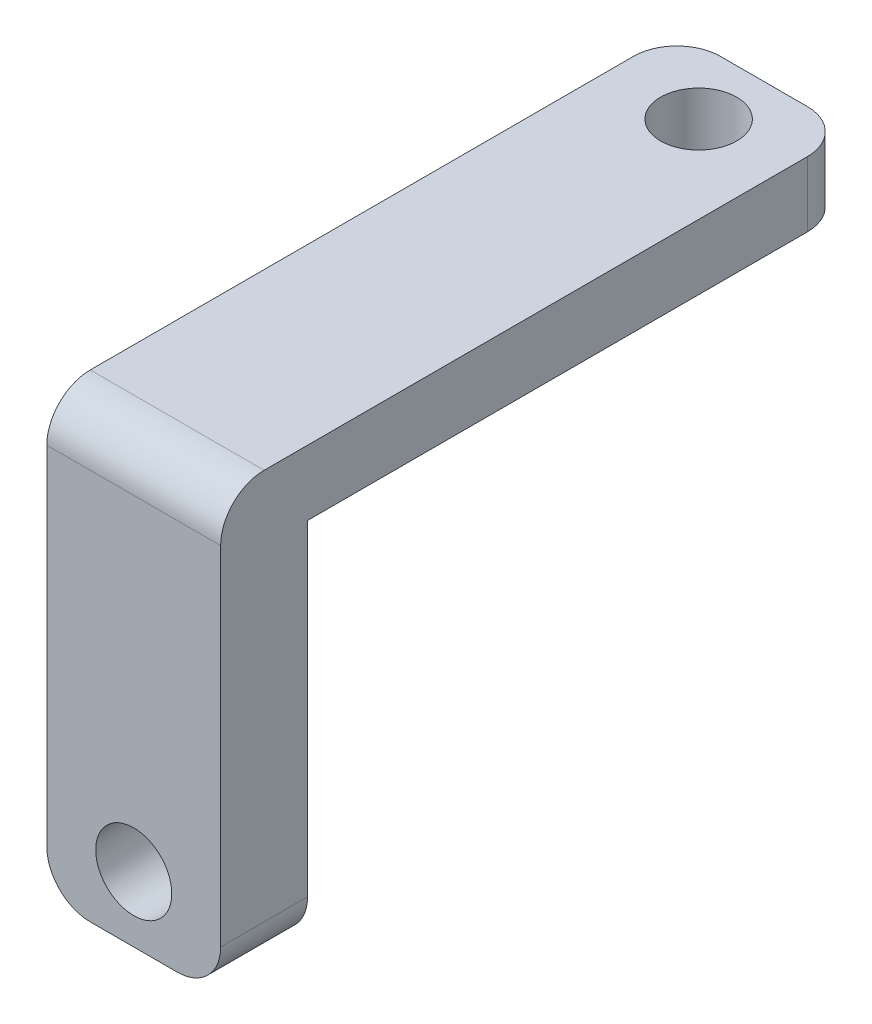
ISO-10303-21;
HEADER;
FILE_DESCRIPTION(('STEP AP214'),'2;1');
FILE_NAME('part.step','',(''),(''),'','','');
FILE_SCHEMA(('AUTOMOTIVE_DESIGN { 1 0 10303 214 1 1 1 1 }'));
ENDSEC;
DATA;
#1=APPLICATION_CONTEXT('core data for automotive mechanical design processes');
#2=APPLICATION_PROTOCOL_DEFINITION('international standard','automotive_design',2000,#1);
#3=PRODUCT_CONTEXT('',#1,'mechanical');
#4=PRODUCT('Part','Part','',(#3));
#5=PRODUCT_RELATED_PRODUCT_CATEGORY('part','',(#4));
#6=PRODUCT_DEFINITION_FORMATION('','',#4);
#7=PRODUCT_DEFINITION_CONTEXT('part definition',#1,'design');
#8=PRODUCT_DEFINITION('design','',#6,#7);
#9=PRODUCT_DEFINITION_SHAPE('','',#8);
#10=(LENGTH_UNIT() NAMED_UNIT(*) SI_UNIT(.MILLI.,.METRE.));
#11=(NAMED_UNIT(*) PLANE_ANGLE_UNIT() SI_UNIT($,.RADIAN.));
#12=(NAMED_UNIT(*) SI_UNIT($,.STERADIAN.) SOLID_ANGLE_UNIT());
#13=UNCERTAINTY_MEASURE_WITH_UNIT(LENGTH_MEASURE(1.E-05),#10,'distance_accuracy_value','');
#14=(GEOMETRIC_REPRESENTATION_CONTEXT(3) GLOBAL_UNCERTAINTY_ASSIGNED_CONTEXT((#13)) GLOBAL_UNIT_ASSIGNED_CONTEXT((#10,
#11,#12)) REPRESENTATION_CONTEXT('',''));
#15=CARTESIAN_POINT('',(0.,0.,0.));
#16=DIRECTION('',(0.,0.,1.));
#17=DIRECTION('',(1.,0.,0.));
#18=AXIS2_PLACEMENT_3D('',#15,#16,#17);
#19=CARTESIAN_POINT('',(0.,3.,0.));
#20=DIRECTION('',(0.,1.,0.));
#21=DIRECTION('',(0.,0.,1.));
#22=AXIS2_PLACEMENT_3D('',#19,#20,#21);
#23=PLANE('',#22);
#24=DIRECTION('',(0.,0.,1.));
#25=VECTOR('',#24,1.);
#26=CARTESIAN_POINT('',(-4.,3.,-12.5));
#27=LINE('',#26,#25);
#28=CARTESIAN_POINT('',(-4.,3.,-10.5));
#29=VERTEX_POINT('',#28);
#30=CARTESIAN_POINT('',(-4.,3.,14.5));
#31=VERTEX_POINT('',#30);
#32=EDGE_CURVE('E164',#29,#31,#27,.T.);
#33=ORIENTED_EDGE('',*,*,#32,.T.);
#34=DIRECTION('',(-1.,0.,0.));
#35=VECTOR('',#34,1.);
#36=CARTESIAN_POINT('',(0.,3.,14.5));
#37=LINE('',#36,#35);
#38=CARTESIAN_POINT('',(4.,3.,14.5));
#39=VERTEX_POINT('',#38);
#40=EDGE_CURVE('E192',#31,#39,#37,.F.);
#41=ORIENTED_EDGE('',*,*,#40,.T.);
#42=DIRECTION('',(0.,0.,-1.));
#43=VECTOR('',#42,1.);
#44=CARTESIAN_POINT('',(4.,3.,-12.5));
#45=LINE('',#44,#43);
#46=CARTESIAN_POINT('',(4.,3.,-10.5));
#47=VERTEX_POINT('',#46);
#48=EDGE_CURVE('E231',#39,#47,#45,.T.);
#49=ORIENTED_EDGE('',*,*,#48,.T.);
#50=CARTESIAN_POINT('',(2.,3.,-10.5));
#51=DIRECTION('',(0.,1.,0.));
#52=DIRECTION('',(0.,0.,1.));
#53=AXIS2_PLACEMENT_3D('',#50,#51,#52);
#54=CIRCLE('',#53,2.);
#55=CARTESIAN_POINT('',(2.,3.,-12.5));
#56=VERTEX_POINT('',#55);
#57=EDGE_CURVE('E186',#47,#56,#54,.T.);
#58=ORIENTED_EDGE('',*,*,#57,.T.);
#59=DIRECTION('',(-1.,0.,0.));
#60=VECTOR('',#59,1.);
#61=CARTESIAN_POINT('',(-4.,3.,-12.5));
#62=LINE('',#61,#60);
#63=CARTESIAN_POINT('',(-2.,3.,-12.5));
#64=VERTEX_POINT('',#63);
#65=EDGE_CURVE('E169',#56,#64,#62,.T.);
#66=ORIENTED_EDGE('',*,*,#65,.T.);
#67=CARTESIAN_POINT('',(-2.,3.,-10.5));
#68=DIRECTION('',(0.,1.,0.));
#69=DIRECTION('',(0.,0.,1.));
#70=AXIS2_PLACEMENT_3D('',#67,#68,#69);
#71=CIRCLE('',#70,2.);
#72=EDGE_CURVE('E189',#64,#29,#71,.T.);
#73=ORIENTED_EDGE('',*,*,#72,.T.);
#74=EDGE_LOOP('',(#33,#41,#49,#58,#66,#73));
#75=FACE_BOUND('',#74,.T.);
#76=CARTESIAN_POINT('',(0.,3.,-9.5));
#77=DIRECTION('',(0.,1.,0.));
#78=DIRECTION('',(0.,0.,1.));
#79=AXIS2_PLACEMENT_3D('',#76,#77,#78);
#80=CIRCLE('',#79,1.75);
#81=CARTESIAN_POINT('',(0.,3.,-7.75));
#82=VERTEX_POINT('',#81);
#83=EDGE_CURVE('E158',#82,#82,#80,.T.);
#84=ORIENTED_EDGE('',*,*,#83,.F.);
#85=EDGE_LOOP('',(#84));
#86=FACE_BOUND('',#85,.T.);
#87=ADVANCED_FACE('F43',(#75,#86),#23,.T.);
#88=CARTESIAN_POINT('',(0.,0.,0.));
#89=DIRECTION('',(0.,1.,0.));
#90=DIRECTION('',(0.,0.,1.));
#91=AXIS2_PLACEMENT_3D('',#88,#89,#90);
#92=PLANE('',#91);
#93=DIRECTION('',(0.,0.,1.));
#94=VECTOR('',#93,1.);
#95=CARTESIAN_POINT('',(-4.,0.,-12.5));
#96=LINE('',#95,#94);
#97=CARTESIAN_POINT('',(-4.,0.,-10.5));
#98=VERTEX_POINT('',#97);
#99=CARTESIAN_POINT('',(-4.,0.,12.5));
#100=VERTEX_POINT('',#99);
#101=EDGE_CURVE('E155',#98,#100,#96,.T.);
#102=ORIENTED_EDGE('',*,*,#101,.F.);
#103=CARTESIAN_POINT('',(-2.,0.,-10.5));
#104=DIRECTION('',(0.,1.,0.));
#105=DIRECTION('',(0.,0.,1.));
#106=AXIS2_PLACEMENT_3D('',#103,#104,#105);
#107=CIRCLE('',#106,2.);
#108=CARTESIAN_POINT('',(-2.,0.,-12.5));
#109=VERTEX_POINT('',#108);
#110=EDGE_CURVE('E59',#98,#109,#107,.F.);
#111=ORIENTED_EDGE('',*,*,#110,.T.);
#112=DIRECTION('',(-1.,0.,0.));
#113=VECTOR('',#112,1.);
#114=CARTESIAN_POINT('',(-4.,0.,-12.5));
#115=LINE('',#114,#113);
#116=CARTESIAN_POINT('',(2.,0.,-12.5));
#117=VERTEX_POINT('',#116);
#118=EDGE_CURVE('E149',#117,#109,#115,.T.);
#119=ORIENTED_EDGE('',*,*,#118,.F.);
#120=CARTESIAN_POINT('',(2.,0.,-10.5));
#121=DIRECTION('',(0.,1.,0.));
#122=DIRECTION('',(0.,0.,1.));
#123=AXIS2_PLACEMENT_3D('',#120,#121,#122);
#124=CIRCLE('',#123,2.);
#125=CARTESIAN_POINT('',(4.,0.,-10.5));
#126=VERTEX_POINT('',#125);
#127=EDGE_CURVE('E67',#117,#126,#124,.F.);
#128=ORIENTED_EDGE('',*,*,#127,.T.);
#129=DIRECTION('',(0.,0.,-1.));
#130=VECTOR('',#129,1.);
#131=CARTESIAN_POINT('',(4.,0.,-12.5));
#132=LINE('',#131,#130);
#133=CARTESIAN_POINT('',(4.,0.,12.5));
#134=VERTEX_POINT('',#133);
#135=EDGE_CURVE('E133',#134,#126,#132,.T.);
#136=ORIENTED_EDGE('',*,*,#135,.F.);
#137=DIRECTION('',(1.,0.,0.));
#138=VECTOR('',#137,1.);
#139=CARTESIAN_POINT('',(-4.,0.,12.5));
#140=LINE('',#139,#138);
#141=EDGE_CURVE('E146',#100,#134,#140,.T.);
#142=ORIENTED_EDGE('',*,*,#141,.F.);
#143=EDGE_LOOP('',(#102,#111,#119,#128,#136,#142));
#144=FACE_BOUND('',#143,.T.);
#145=CARTESIAN_POINT('',(0.,0.,-9.5));
#146=DIRECTION('',(0.,1.,0.));
#147=DIRECTION('',(0.,0.,1.));
#148=AXIS2_PLACEMENT_3D('',#145,#146,#147);
#149=CIRCLE('',#148,1.75);
#150=CARTESIAN_POINT('',(0.,0.,-7.75));
#151=VERTEX_POINT('',#150);
#152=EDGE_CURVE('E240',#151,#151,#149,.T.);
#153=ORIENTED_EDGE('',*,*,#152,.T.);
#154=EDGE_LOOP('',(#153));
#155=FACE_BOUND('',#154,.T.);
#156=ADVANCED_FACE('F144',(#144,#155),#92,.F.);
#157=CARTESIAN_POINT('',(-4.,3.,-12.5));
#158=DIRECTION('',(1.,0.,0.));
#159=DIRECTION('',(0.,0.,-1.));
#160=AXIS2_PLACEMENT_3D('',#157,#158,#159);
#161=PLANE('',#160);
#162=DIRECTION('',(0.,-1.,0.));
#163=VECTOR('',#162,1.);
#164=CARTESIAN_POINT('',(-4.,3.,16.5));
#165=LINE('',#164,#163);
#166=CARTESIAN_POINT('',(-4.,1.,16.5));
#167=VERTEX_POINT('',#166);
#168=CARTESIAN_POINT('',(-4.,-15.,16.5));
#169=VERTEX_POINT('',#168);
#170=EDGE_CURVE('E140',#167,#169,#165,.T.);
#171=ORIENTED_EDGE('',*,*,#170,.F.);
#172=CARTESIAN_POINT('',(-4.,1.,14.5));
#173=DIRECTION('',(1.,0.,0.));
#174=DIRECTION('',(0.,0.,-1.));
#175=AXIS2_PLACEMENT_3D('',#172,#173,#174);
#176=CIRCLE('',#175,2.);
#177=EDGE_CURVE('E183',#167,#31,#176,.F.);
#178=ORIENTED_EDGE('',*,*,#177,.T.);
#179=ORIENTED_EDGE('',*,*,#32,.F.);
#180=DIRECTION('',(0.,-1.,0.));
#181=VECTOR('',#180,1.);
#182=CARTESIAN_POINT('',(-4.,3.,-10.5));
#183=LINE('',#182,#181);
#184=EDGE_CURVE('E176',#29,#98,#183,.T.);
#185=ORIENTED_EDGE('',*,*,#184,.T.);
#186=ORIENTED_EDGE('',*,*,#101,.T.);
#187=DIRECTION('',(0.,-1.,0.));
#188=VECTOR('',#187,1.);
#189=CARTESIAN_POINT('',(-4.,3.,12.5));
#190=LINE('',#189,#188);
#191=CARTESIAN_POINT('',(-4.,-15.,12.5));
#192=VERTEX_POINT('',#191);
#193=EDGE_CURVE('E153',#100,#192,#190,.T.);
#194=ORIENTED_EDGE('',*,*,#193,.T.);
#195=DIRECTION('',(0.,0.,-1.));
#196=VECTOR('',#195,1.);
#197=CARTESIAN_POINT('',(-4.,-15.,-12.5));
#198=LINE('',#197,#196);
#199=EDGE_CURVE('E180',#192,#169,#198,.F.);
#200=ORIENTED_EDGE('',*,*,#199,.T.);
#201=EDGE_LOOP('',(#171,#178,#179,#185,#186,#194,#200));
#202=FACE_BOUND('',#201,.T.);
#203=ADVANCED_FACE('F295',(#202),#161,.F.);
#204=CARTESIAN_POINT('',(4.,3.,-12.5));
#205=DIRECTION('',(-1.,0.,0.));
#206=DIRECTION('',(0.,0.,1.));
#207=AXIS2_PLACEMENT_3D('',#204,#205,#206);
#208=PLANE('',#207);
#209=ORIENTED_EDGE('',*,*,#48,.F.);
#210=CARTESIAN_POINT('',(4.,1.,14.5));
#211=DIRECTION('',(-1.,0.,0.));
#212=DIRECTION('',(0.,0.,1.));
#213=AXIS2_PLACEMENT_3D('',#210,#211,#212);
#214=CIRCLE('',#213,2.);
#215=CARTESIAN_POINT('',(4.,1.,16.5));
#216=VERTEX_POINT('',#215);
#217=EDGE_CURVE('E200',#39,#216,#214,.F.);
#218=ORIENTED_EDGE('',*,*,#217,.T.);
#219=DIRECTION('',(0.,1.,0.));
#220=VECTOR('',#219,1.);
#221=CARTESIAN_POINT('',(4.,3.,16.5));
#222=LINE('',#221,#220);
#223=CARTESIAN_POINT('',(4.,-15.,16.5));
#224=VERTEX_POINT('',#223);
#225=EDGE_CURVE('E244',#224,#216,#222,.T.);
#226=ORIENTED_EDGE('',*,*,#225,.F.);
#227=DIRECTION('',(0.,0.,-1.));
#228=VECTOR('',#227,1.);
#229=CARTESIAN_POINT('',(4.,-15.,-12.5));
#230=LINE('',#229,#228);
#231=CARTESIAN_POINT('',(4.,-15.,12.5));
#232=VERTEX_POINT('',#231);
#233=EDGE_CURVE('E136',#224,#232,#230,.T.);
#234=ORIENTED_EDGE('',*,*,#233,.T.);
#235=DIRECTION('',(0.,1.,0.));
#236=VECTOR('',#235,1.);
#237=CARTESIAN_POINT('',(4.,3.,12.5));
#238=LINE('',#237,#236);
#239=EDGE_CURVE('E129',#232,#134,#238,.T.);
#240=ORIENTED_EDGE('',*,*,#239,.T.);
#241=ORIENTED_EDGE('',*,*,#135,.T.);
#242=DIRECTION('',(0.,-1.,0.));
#243=VECTOR('',#242,1.);
#244=CARTESIAN_POINT('',(4.,3.,-10.5));
#245=LINE('',#244,#243);
#246=EDGE_CURVE('E195',#126,#47,#245,.F.);
#247=ORIENTED_EDGE('',*,*,#246,.T.);
#248=EDGE_LOOP('',(#209,#218,#226,#234,#240,#241,#247));
#249=FACE_BOUND('',#248,.T.);
#250=ADVANCED_FACE('F132',(#249),#208,.F.);
#251=CARTESIAN_POINT('',(-4.,3.,-12.5));
#252=DIRECTION('',(0.,0.,1.));
#253=DIRECTION('',(1.,0.,0.));
#254=AXIS2_PLACEMENT_3D('',#251,#252,#253);
#255=PLANE('',#254);
#256=ORIENTED_EDGE('',*,*,#118,.T.);
#257=DIRECTION('',(0.,-1.,0.));
#258=VECTOR('',#257,1.);
#259=CARTESIAN_POINT('',(-2.,3.,-12.5));
#260=LINE('',#259,#258);
#261=EDGE_CURVE('E11',#109,#64,#260,.F.);
#262=ORIENTED_EDGE('',*,*,#261,.T.);
#263=ORIENTED_EDGE('',*,*,#65,.F.);
#264=DIRECTION('',(0.,-1.,0.));
#265=VECTOR('',#264,1.);
#266=CARTESIAN_POINT('',(2.,3.,-12.5));
#267=LINE('',#266,#265);
#268=EDGE_CURVE('E52',#56,#117,#267,.T.);
#269=ORIENTED_EDGE('',*,*,#268,.T.);
#270=EDGE_LOOP('',(#256,#262,#263,#269));
#271=FACE_BOUND('',#270,.T.);
#272=ADVANCED_FACE('F222',(#271),#255,.F.);
#273=CARTESIAN_POINT('',(0.,3.,-9.5));
#274=DIRECTION('',(0.,-1.,0.));
#275=DIRECTION('',(0.,0.,-1.));
#276=AXIS2_PLACEMENT_3D('',#273,#274,#275);
#277=CYLINDRICAL_SURFACE('',#276,1.75);
#278=ORIENTED_EDGE('',*,*,#83,.T.);
#279=EDGE_LOOP('',(#278));
#280=FACE_BOUND('',#279,.T.);
#281=ORIENTED_EDGE('',*,*,#152,.F.);
#282=EDGE_LOOP('',(#281));
#283=FACE_BOUND('',#282,.T.);
#284=ADVANCED_FACE('F286',(#280,#283),#277,.F.);
#285=CARTESIAN_POINT('',(0.,0.,12.5));
#286=DIRECTION('',(0.,0.,1.));
#287=DIRECTION('',(1.,0.,0.));
#288=AXIS2_PLACEMENT_3D('',#285,#286,#287);
#289=PLANE('',#288);
#290=CARTESIAN_POINT('',(0.,-14.,12.5));
#291=DIRECTION('',(0.,0.,1.));
#292=DIRECTION('',(1.,0.,0.));
#293=AXIS2_PLACEMENT_3D('',#290,#291,#292);
#294=CIRCLE('',#293,1.75);
#295=CARTESIAN_POINT('',(1.75,-14.,12.5));
#296=VERTEX_POINT('',#295);
#297=EDGE_CURVE('E264',#296,#296,#294,.T.);
#298=ORIENTED_EDGE('',*,*,#297,.T.);
#299=EDGE_LOOP('',(#298));
#300=FACE_BOUND('',#299,.T.);
#301=ORIENTED_EDGE('',*,*,#239,.F.);
#302=CARTESIAN_POINT('',(2.,-15.,12.5));
#303=DIRECTION('',(0.,0.,1.));
#304=DIRECTION('',(1.,0.,0.));
#305=AXIS2_PLACEMENT_3D('',#302,#303,#304);
#306=CIRCLE('',#305,2.);
#307=CARTESIAN_POINT('',(2.,-17.,12.5));
#308=VERTEX_POINT('',#307);
#309=EDGE_CURVE('E206',#232,#308,#306,.F.);
#310=ORIENTED_EDGE('',*,*,#309,.T.);
#311=DIRECTION('',(1.,0.,0.));
#312=VECTOR('',#311,1.);
#313=CARTESIAN_POINT('',(-4.,-17.,12.5));
#314=LINE('',#313,#312);
#315=CARTESIAN_POINT('',(-2.,-17.,12.5));
#316=VERTEX_POINT('',#315);
#317=EDGE_CURVE('E141',#316,#308,#314,.T.);
#318=ORIENTED_EDGE('',*,*,#317,.F.);
#319=CARTESIAN_POINT('',(-2.,-15.,12.5));
#320=DIRECTION('',(0.,0.,1.));
#321=DIRECTION('',(1.,0.,0.));
#322=AXIS2_PLACEMENT_3D('',#319,#320,#321);
#323=CIRCLE('',#322,2.);
#324=EDGE_CURVE('E203',#316,#192,#323,.F.);
#325=ORIENTED_EDGE('',*,*,#324,.T.);
#326=ORIENTED_EDGE('',*,*,#193,.F.);
#327=ORIENTED_EDGE('',*,*,#141,.T.);
#328=EDGE_LOOP('',(#301,#310,#318,#325,#326,#327));
#329=FACE_BOUND('',#328,.T.);
#330=ADVANCED_FACE('F151',(#300,#329),#289,.F.);
#331=CARTESIAN_POINT('',(0.,0.,16.5));
#332=DIRECTION('',(0.,0.,1.));
#333=DIRECTION('',(1.,0.,0.));
#334=AXIS2_PLACEMENT_3D('',#331,#332,#333);
#335=PLANE('',#334);
#336=ORIENTED_EDGE('',*,*,#225,.T.);
#337=DIRECTION('',(-1.,0.,0.));
#338=VECTOR('',#337,1.);
#339=CARTESIAN_POINT('',(0.,1.,16.5));
#340=LINE('',#339,#338);
#341=EDGE_CURVE('E172',#216,#167,#340,.T.);
#342=ORIENTED_EDGE('',*,*,#341,.T.);
#343=ORIENTED_EDGE('',*,*,#170,.T.);
#344=CARTESIAN_POINT('',(-2.,-15.,16.5));
#345=DIRECTION('',(0.,0.,1.));
#346=DIRECTION('',(1.,0.,0.));
#347=AXIS2_PLACEMENT_3D('',#344,#345,#346);
#348=CIRCLE('',#347,2.);
#349=CARTESIAN_POINT('',(-2.,-17.,16.5));
#350=VERTEX_POINT('',#349);
#351=EDGE_CURVE('E165',#169,#350,#348,.T.);
#352=ORIENTED_EDGE('',*,*,#351,.T.);
#353=DIRECTION('',(1.,0.,0.));
#354=VECTOR('',#353,1.);
#355=CARTESIAN_POINT('',(-4.,-17.,16.5));
#356=LINE('',#355,#354);
#357=CARTESIAN_POINT('',(2.,-17.,16.5));
#358=VERTEX_POINT('',#357);
#359=EDGE_CURVE('E257',#350,#358,#356,.T.);
#360=ORIENTED_EDGE('',*,*,#359,.T.);
#361=CARTESIAN_POINT('',(2.,-15.,16.5));
#362=DIRECTION('',(0.,0.,1.));
#363=DIRECTION('',(1.,0.,0.));
#364=AXIS2_PLACEMENT_3D('',#361,#362,#363);
#365=CIRCLE('',#364,2.);
#366=EDGE_CURVE('E168',#358,#224,#365,.T.);
#367=ORIENTED_EDGE('',*,*,#366,.T.);
#368=EDGE_LOOP('',(#336,#342,#343,#352,#360,#367));
#369=FACE_BOUND('',#368,.T.);
#370=CARTESIAN_POINT('',(0.,-14.,16.5));
#371=DIRECTION('',(0.,0.,1.));
#372=DIRECTION('',(1.,0.,0.));
#373=AXIS2_PLACEMENT_3D('',#370,#371,#372);
#374=CIRCLE('',#373,1.75);
#375=CARTESIAN_POINT('',(1.75,-14.,16.5));
#376=VERTEX_POINT('',#375);
#377=EDGE_CURVE('E253',#376,#376,#374,.T.);
#378=ORIENTED_EDGE('',*,*,#377,.F.);
#379=EDGE_LOOP('',(#378));
#380=FACE_BOUND('',#379,.T.);
#381=ADVANCED_FACE('F275',(#369,#380),#335,.T.);
#382=CARTESIAN_POINT('',(-4.,-17.,16.5));
#383=DIRECTION('',(0.,1.,0.));
#384=DIRECTION('',(0.,0.,1.));
#385=AXIS2_PLACEMENT_3D('',#382,#383,#384);
#386=PLANE('',#385);
#387=ORIENTED_EDGE('',*,*,#317,.T.);
#388=DIRECTION('',(0.,0.,-1.));
#389=VECTOR('',#388,1.);
#390=CARTESIAN_POINT('',(2.,-17.,16.5));
#391=LINE('',#390,#389);
#392=EDGE_CURVE('E213',#308,#358,#391,.F.);
#393=ORIENTED_EDGE('',*,*,#392,.T.);
#394=ORIENTED_EDGE('',*,*,#359,.F.);
#395=DIRECTION('',(0.,0.,-1.));
#396=VECTOR('',#395,1.);
#397=CARTESIAN_POINT('',(-2.,-17.,16.5));
#398=LINE('',#397,#396);
#399=EDGE_CURVE('E209',#350,#316,#398,.T.);
#400=ORIENTED_EDGE('',*,*,#399,.T.);
#401=EDGE_LOOP('',(#387,#393,#394,#400));
#402=FACE_BOUND('',#401,.T.);
#403=ADVANCED_FACE('F277',(#402),#386,.F.);
#404=CARTESIAN_POINT('',(0.,-14.,16.5));
#405=DIRECTION('',(0.,0.,-1.));
#406=DIRECTION('',(-1.,0.,0.));
#407=AXIS2_PLACEMENT_3D('',#404,#405,#406);
#408=CYLINDRICAL_SURFACE('',#407,1.75);
#409=ORIENTED_EDGE('',*,*,#377,.T.);
#410=EDGE_LOOP('',(#409));
#411=FACE_BOUND('',#410,.T.);
#412=ORIENTED_EDGE('',*,*,#297,.F.);
#413=EDGE_LOOP('',(#412));
#414=FACE_BOUND('',#413,.T.);
#415=ADVANCED_FACE('F272',(#411,#414),#408,.F.);
#416=CARTESIAN_POINT('',(0.,1.,14.5));
#417=DIRECTION('',(-1.,0.,0.));
#418=DIRECTION('',(0.,0.,1.));
#419=AXIS2_PLACEMENT_3D('',#416,#417,#418);
#420=CYLINDRICAL_SURFACE('',#419,2.);
#421=ORIENTED_EDGE('',*,*,#217,.F.);
#422=ORIENTED_EDGE('',*,*,#40,.F.);
#423=ORIENTED_EDGE('',*,*,#177,.F.);
#424=ORIENTED_EDGE('',*,*,#341,.F.);
#425=EDGE_LOOP('',(#421,#422,#423,#424));
#426=FACE_BOUND('',#425,.T.);
#427=ADVANCED_FACE('F306',(#426),#420,.T.);
#428=CARTESIAN_POINT('',(2.,-15.,-12.5));
#429=DIRECTION('',(0.,0.,-1.));
#430=DIRECTION('',(-1.,0.,0.));
#431=AXIS2_PLACEMENT_3D('',#428,#429,#430);
#432=CYLINDRICAL_SURFACE('',#431,2.);
#433=ORIENTED_EDGE('',*,*,#366,.F.);
#434=ORIENTED_EDGE('',*,*,#392,.F.);
#435=ORIENTED_EDGE('',*,*,#309,.F.);
#436=ORIENTED_EDGE('',*,*,#233,.F.);
#437=EDGE_LOOP('',(#433,#434,#435,#436));
#438=FACE_BOUND('',#437,.T.);
#439=ADVANCED_FACE('F309',(#438),#432,.T.);
#440=CARTESIAN_POINT('',(-2.,-15.,16.5));
#441=DIRECTION('',(0.,0.,-1.));
#442=DIRECTION('',(-1.,0.,0.));
#443=AXIS2_PLACEMENT_3D('',#440,#441,#442);
#444=CYLINDRICAL_SURFACE('',#443,2.);
#445=ORIENTED_EDGE('',*,*,#351,.F.);
#446=ORIENTED_EDGE('',*,*,#199,.F.);
#447=ORIENTED_EDGE('',*,*,#324,.F.);
#448=ORIENTED_EDGE('',*,*,#399,.F.);
#449=EDGE_LOOP('',(#445,#446,#447,#448));
#450=FACE_BOUND('',#449,.T.);
#451=ADVANCED_FACE('F313',(#450),#444,.T.);
#452=CARTESIAN_POINT('',(-2.,3.,-10.5));
#453=DIRECTION('',(0.,-1.,0.));
#454=DIRECTION('',(0.,0.,-1.));
#455=AXIS2_PLACEMENT_3D('',#452,#453,#454);
#456=CYLINDRICAL_SURFACE('',#455,2.);
#457=ORIENTED_EDGE('',*,*,#72,.F.);
#458=ORIENTED_EDGE('',*,*,#261,.F.);
#459=ORIENTED_EDGE('',*,*,#110,.F.);
#460=ORIENTED_EDGE('',*,*,#184,.F.);
#461=EDGE_LOOP('',(#457,#458,#459,#460));
#462=FACE_BOUND('',#461,.T.);
#463=ADVANCED_FACE('F316',(#462),#456,.T.);
#464=CARTESIAN_POINT('',(2.,3.,-10.5));
#465=DIRECTION('',(0.,-1.,0.));
#466=DIRECTION('',(0.,0.,-1.));
#467=AXIS2_PLACEMENT_3D('',#464,#465,#466);
#468=CYLINDRICAL_SURFACE('',#467,2.);
#469=ORIENTED_EDGE('',*,*,#57,.F.);
#470=ORIENTED_EDGE('',*,*,#246,.F.);
#471=ORIENTED_EDGE('',*,*,#127,.F.);
#472=ORIENTED_EDGE('',*,*,#268,.F.);
#473=EDGE_LOOP('',(#469,#470,#471,#472));
#474=FACE_BOUND('',#473,.T.);
#475=ADVANCED_FACE('F45',(#474),#468,.T.);
#476=CLOSED_SHELL('',(#87,#156,#203,#250,#272,#284,#330,#381,#403,#415,#427,#439,#451,#463,#475));
#477=MANIFOLD_SOLID_BREP('B2',#476);
#478=ADVANCED_BREP_SHAPE_REPRESENTATION('',(#18,#477),#14);
#479=SHAPE_DEFINITION_REPRESENTATION(#9,#478);
ENDSEC;
END-ISO-10303-21;
